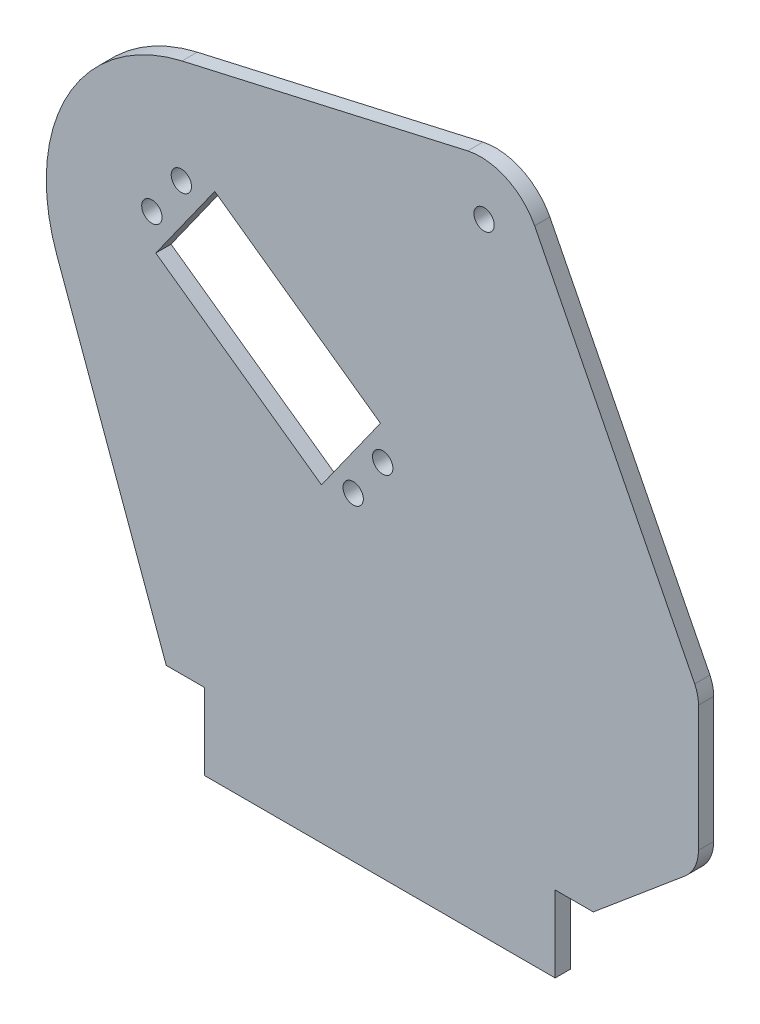
ISO-10303-21;
HEADER;
FILE_DESCRIPTION(('STEP AP214'),'2;1');
FILE_NAME('part.step','',(''),(''),'','','');
FILE_SCHEMA(('AUTOMOTIVE_DESIGN { 1 0 10303 214 1 1 1 1 }'));
ENDSEC;
DATA;
#1=APPLICATION_CONTEXT('core data for automotive mechanical design processes');
#2=APPLICATION_PROTOCOL_DEFINITION('international standard','automotive_design',2000,#1);
#3=PRODUCT_CONTEXT('',#1,'mechanical');
#4=PRODUCT('Part','Part','',(#3));
#5=PRODUCT_RELATED_PRODUCT_CATEGORY('part','',(#4));
#6=PRODUCT_DEFINITION_FORMATION('','',#4);
#7=PRODUCT_DEFINITION_CONTEXT('part definition',#1,'design');
#8=PRODUCT_DEFINITION('design','',#6,#7);
#9=PRODUCT_DEFINITION_SHAPE('','',#8);
#10=(LENGTH_UNIT() NAMED_UNIT(*) SI_UNIT(.MILLI.,.METRE.));
#11=(NAMED_UNIT(*) PLANE_ANGLE_UNIT() SI_UNIT($,.RADIAN.));
#12=(NAMED_UNIT(*) SI_UNIT($,.STERADIAN.) SOLID_ANGLE_UNIT());
#13=UNCERTAINTY_MEASURE_WITH_UNIT(LENGTH_MEASURE(1.E-05),#10,'distance_accuracy_value','');
#14=(GEOMETRIC_REPRESENTATION_CONTEXT(3) GLOBAL_UNCERTAINTY_ASSIGNED_CONTEXT((#13)) GLOBAL_UNIT_ASSIGNED_CONTEXT((#10,
#11,#12)) REPRESENTATION_CONTEXT('',''));
#15=CARTESIAN_POINT('',(0.,0.,0.));
#16=DIRECTION('',(0.,0.,1.));
#17=DIRECTION('',(1.,0.,0.));
#18=AXIS2_PLACEMENT_3D('',#15,#16,#17);
#19=CARTESIAN_POINT('',(52.5379588387498,0.97003609089329,3.));
#20=DIRECTION('',(0.,0.,1.));
#21=DIRECTION('',(1.,0.,0.));
#22=AXIS2_PLACEMENT_3D('',#19,#20,#21);
#23=PLANE('',#22);
#24=CARTESIAN_POINT('',(-41.6686655132375,39.4390380218527,3.));
#25=DIRECTION('',(0.,0.,1.));
#26=DIRECTION('',(1.,0.,0.));
#27=AXIS2_PLACEMENT_3D('',#24,#25,#26);
#28=CIRCLE('',#27,2.);
#29=CARTESIAN_POINT('',(-39.6686655132375,39.4390380218527,3.));
#30=VERTEX_POINT('',#29);
#31=EDGE_CURVE('E200',#30,#30,#28,.T.);
#32=ORIENTED_EDGE('',*,*,#31,.F.);
#33=EDGE_LOOP('',(#32));
#34=FACE_BOUND('',#33,.T.);
#35=CARTESIAN_POINT('',(-2.07349824916435,11.2577901905364,3.));
#36=DIRECTION('',(0.,0.,1.));
#37=DIRECTION('',(1.,0.,0.));
#38=AXIS2_PLACEMENT_3D('',#35,#36,#37);
#39=CIRCLE('',#38,2.);
#40=CARTESIAN_POINT('',(-0.0734982491643488,11.2577901905364,3.));
#41=VERTEX_POINT('',#40);
#42=EDGE_CURVE('E212',#41,#41,#39,.T.);
#43=ORIENTED_EDGE('',*,*,#42,.F.);
#44=EDGE_LOOP('',(#43));
#45=FACE_BOUND('',#44,.T.);
#46=CARTESIAN_POINT('',(52.5379588387498,0.97003609089329,3.));
#47=DIRECTION('',(0.,0.,1.));
#48=DIRECTION('',(1.,0.,0.));
#49=AXIS2_PLACEMENT_3D('',#46,#47,#48);
#50=CIRCLE('',#49,7.49999999999989);
#51=CARTESIAN_POINT('',(60.0379588387497,0.970036375484584,3.));
#52=VERTEX_POINT('',#51);
#53=CARTESIAN_POINT('',(59.2977934399142,4.21882604484534,3.));
#54=VERTEX_POINT('',#53);
#55=EDGE_CURVE('E224',#52,#54,#50,.T.);
#56=ORIENTED_EDGE('',*,*,#55,.T.);
#57=DIRECTION('',(-0.451103233471447,0.89247177700564,0.));
#58=VECTOR('',#57,1.);
#59=CARTESIAN_POINT('',(59.2977934399142,4.21882604484534,3.));
#60=LINE('',#59,#58);
#61=CARTESIAN_POINT('',(27.815049638073,66.5049242614765,3.));
#62=VERTEX_POINT('',#61);
#63=EDGE_CURVE('E227',#54,#62,#60,.T.);
#64=ORIENTED_EDGE('',*,*,#63,.T.);
#65=CARTESIAN_POINT('',(17.1739329491683,60.9581562283685,3.));
#66=DIRECTION('',(0.,0.,1.));
#67=DIRECTION('',(1.,0.,0.));
#68=AXIS2_PLACEMENT_3D('',#65,#66,#67);
#69=CIRCLE('',#68,11.9999999999998);
#70=CARTESIAN_POINT('',(14.6587671564007,72.6916101544248,3.));
#71=VERTEX_POINT('',#70);
#72=EDGE_CURVE('E230',#62,#71,#69,.T.);
#73=ORIENTED_EDGE('',*,*,#72,.T.);
#74=DIRECTION('',(-0.97509386621173,-0.221792587965108,0.));
#75=VECTOR('',#74,1.);
#76=CARTESIAN_POINT('',(14.6587671564007,72.6916101544248,3.));
#77=LINE('',#76,#75);
#78=CARTESIAN_POINT('',(-41.5350852683588,59.9098868876818,3.));
#79=VERTEX_POINT('',#78);
#80=EDGE_CURVE('E232',#71,#79,#77,.T.);
#81=ORIENTED_EDGE('',*,*,#80,.T.);
#82=CARTESIAN_POINT('',(-33.7366930159698,26.3028180140377,3.));
#83=DIRECTION('',(0.,0.,1.));
#84=DIRECTION('',(1.,0.,0.));
#85=AXIS2_PLACEMENT_3D('',#82,#83,#84);
#86=CIRCLE('',#85,34.4999999999997);
#87=CARTESIAN_POINT('',(-66.1560883434372,14.5031228230017,3.));
#88=VERTEX_POINT('',#87);
#89=EDGE_CURVE('E234',#79,#88,#86,.T.);
#90=ORIENTED_EDGE('',*,*,#89,.T.);
#91=DIRECTION('',(0.342020150464813,-0.939692618187472,0.));
#92=VECTOR('',#91,1.);
#93=CARTESIAN_POINT('',(-66.1560883434372,14.5031228230017,3.));
#94=LINE('',#93,#92);
#95=CARTESIAN_POINT('',(-44.6452411893587,-44.5974426091107,3.));
#96=VERTEX_POINT('',#95);
#97=EDGE_CURVE('E236',#88,#96,#94,.T.);
#98=ORIENTED_EDGE('',*,*,#97,.T.);
#99=DIRECTION('',(1.,0.,0.));
#100=VECTOR('',#99,1.);
#101=CARTESIAN_POINT('',(-44.6452411893587,-44.5974426091107,3.));
#102=LINE('',#101,#100);
#103=CARTESIAN_POINT('',(-37.1452431563582,-44.5974426091106,3.));
#104=VERTEX_POINT('',#103);
#105=EDGE_CURVE('E238',#96,#104,#102,.T.);
#106=ORIENTED_EDGE('',*,*,#105,.T.);
#107=DIRECTION('',(0.,-1.,0.));
#108=VECTOR('',#107,1.);
#109=CARTESIAN_POINT('',(-37.1452431563582,-44.5974426091106,3.));
#110=LINE('',#109,#108);
#111=CARTESIAN_POINT('',(-37.1452431563581,-59.5974426091107,3.));
#112=VERTEX_POINT('',#111);
#113=EDGE_CURVE('E240',#104,#112,#110,.T.);
#114=ORIENTED_EDGE('',*,*,#113,.T.);
#115=DIRECTION('',(1.,0.,0.));
#116=VECTOR('',#115,1.);
#117=CARTESIAN_POINT('',(-37.1452431563581,-59.5974426091107,3.));
#118=LINE('',#117,#116);
#119=CARTESIAN_POINT('',(31.8547568436419,-59.5974426091104,3.));
#120=VERTEX_POINT('',#119);
#121=EDGE_CURVE('E242',#112,#120,#118,.T.);
#122=ORIENTED_EDGE('',*,*,#121,.T.);
#123=DIRECTION('',(0.,1.,0.));
#124=VECTOR('',#123,1.);
#125=CARTESIAN_POINT('',(31.8547568436419,-59.5974426091104,3.));
#126=LINE('',#125,#124);
#127=CARTESIAN_POINT('',(31.8547568436418,-44.5974426091104,3.));
#128=VERTEX_POINT('',#127);
#129=EDGE_CURVE('E244',#120,#128,#126,.T.);
#130=ORIENTED_EDGE('',*,*,#129,.T.);
#131=DIRECTION('',(1.,0.,0.));
#132=VECTOR('',#131,1.);
#133=CARTESIAN_POINT('',(31.8547568436418,-44.5974426091104,3.));
#134=LINE('',#133,#132);
#135=CARTESIAN_POINT('',(39.3524228354522,-44.5974426091104,3.));
#136=VERTEX_POINT('',#135);
#137=EDGE_CURVE('E246',#128,#136,#134,.T.);
#138=ORIENTED_EDGE('',*,*,#137,.T.);
#139=DIRECTION('',(0.766044443118983,0.642787609686533,0.));
#140=VECTOR('',#139,1.);
#141=CARTESIAN_POINT('',(39.3524228354522,-44.5974426091104,3.));
#142=LINE('',#141,#140);
#143=CARTESIAN_POINT('',(57.4728017138443,-29.3926393754591,3.));
#144=VERTEX_POINT('',#143);
#145=EDGE_CURVE('E248',#136,#144,#142,.T.);
#146=ORIENTED_EDGE('',*,*,#145,.T.);
#147=CARTESIAN_POINT('',(52.5379588387497,-23.7448676203214,3.));
#148=DIRECTION('',(0.,0.,1.));
#149=DIRECTION('',(1.,0.,0.));
#150=AXIS2_PLACEMENT_3D('',#147,#148,#149);
#151=CIRCLE('',#150,7.50000000000025);
#152=CARTESIAN_POINT('',(60.0379588387499,-23.7448676203167,3.));
#153=VERTEX_POINT('',#152);
#154=EDGE_CURVE('E250',#144,#153,#151,.T.);
#155=ORIENTED_EDGE('',*,*,#154,.T.);
#156=DIRECTION('',(0.,1.,0.));
#157=VECTOR('',#156,1.);
#158=CARTESIAN_POINT('',(60.0379588387499,-23.7448676203167,3.));
#159=LINE('',#158,#157);
#160=EDGE_CURVE('E252',#153,#52,#159,.T.);
#161=ORIENTED_EDGE('',*,*,#160,.T.);
#162=EDGE_LOOP('',(#56,#64,#73,#81,#90,#98,#106,#114,#122,#130,#138,#146,#155,#161));
#163=FACE_BOUND('',#162,.T.);
#164=CARTESIAN_POINT('',(17.8698857742372,62.635186945819,3.));
#165=DIRECTION('',(0.,0.,1.));
#166=DIRECTION('',(1.,0.,0.));
#167=AXIS2_PLACEMENT_3D('',#164,#165,#166);
#168=CIRCLE('',#167,2.);
#169=CARTESIAN_POINT('',(19.8698857742372,62.635186945819,3.));
#170=VERTEX_POINT('',#169);
#171=EDGE_CURVE('E218',#170,#170,#168,.T.);
#172=ORIENTED_EDGE('',*,*,#171,.F.);
#173=EDGE_LOOP('',(#172));
#174=FACE_BOUND('',#173,.T.);
#175=CARTESIAN_POINT('',(-7.87210891404425,3.11063643249667,3.));
#176=DIRECTION('',(0.,0.,1.));
#177=DIRECTION('',(1.,0.,0.));
#178=AXIS2_PLACEMENT_3D('',#175,#176,#177);
#179=CIRCLE('',#178,2.);
#180=CARTESIAN_POINT('',(-5.87210891404425,3.11063643249667,3.));
#181=VERTEX_POINT('',#180);
#182=EDGE_CURVE('E206',#181,#181,#179,.T.);
#183=ORIENTED_EDGE('',*,*,#182,.F.);
#184=EDGE_LOOP('',(#183));
#185=FACE_BOUND('',#184,.T.);
#186=CARTESIAN_POINT('',(-47.4672761781174,31.291884263813,3.));
#187=DIRECTION('',(0.,0.,1.));
#188=DIRECTION('',(1.,0.,0.));
#189=AXIS2_PLACEMENT_3D('',#186,#187,#188);
#190=CIRCLE('',#189,2.);
#191=CARTESIAN_POINT('',(-45.4672761781174,31.291884263813,3.));
#192=VERTEX_POINT('',#191);
#193=EDGE_CURVE('E194',#192,#192,#190,.T.);
#194=ORIENTED_EDGE('',*,*,#193,.F.);
#195=EDGE_LOOP('',(#194));
#196=FACE_BOUND('',#195,.T.);
#197=DIRECTION('',(-0.814715375803975,0.579861066487989,0.));
#198=VECTOR('',#197,1.);
#199=CARTESIAN_POINT('',(-2.51452595752069,17.7087974421571,3.));
#200=LINE('',#199,#198);
#201=CARTESIAN_POINT('',(-2.51452595752069,17.7087974421571,3.));
#202=VERTEX_POINT('',#201);
#203=CARTESIAN_POINT('',(-35.1031409896797,40.9032401016766,3.));
#204=VERTEX_POINT('',#203);
#205=EDGE_CURVE('E165',#202,#204,#200,.T.);
#206=ORIENTED_EDGE('',*,*,#205,.F.);
#207=DIRECTION('',(0.579861066487989,0.814715375803975,0.));
#208=VECTOR('',#207,1.);
#209=CARTESIAN_POINT('',(-14.1117472872805,1.41448992607758,3.));
#210=LINE('',#209,#208);
#211=CARTESIAN_POINT('',(-14.1117472872805,1.41448992607758,3.));
#212=VERTEX_POINT('',#211);
#213=EDGE_CURVE('E157',#212,#202,#210,.T.);
#214=ORIENTED_EDGE('',*,*,#213,.F.);
#215=DIRECTION('',(0.814715375803975,-0.579861066487989,0.));
#216=VECTOR('',#215,1.);
#217=CARTESIAN_POINT('',(-46.7003623194395,24.6089325855972,3.));
#218=LINE('',#217,#216);
#219=CARTESIAN_POINT('',(-46.7003623194395,24.6089325855972,3.));
#220=VERTEX_POINT('',#219);
#221=EDGE_CURVE('E180',#220,#212,#218,.T.);
#222=ORIENTED_EDGE('',*,*,#221,.F.);
#223=DIRECTION('',(-0.579861066487989,-0.814715375803975,0.));
#224=VECTOR('',#223,1.);
#225=CARTESIAN_POINT('',(-35.1031409896797,40.9032401016766,3.));
#226=LINE('',#225,#224);
#227=EDGE_CURVE('E178',#204,#220,#226,.T.);
#228=ORIENTED_EDGE('',*,*,#227,.F.);
#229=EDGE_LOOP('',(#206,#214,#222,#228));
#230=FACE_BOUND('',#229,.T.);
#231=ADVANCED_FACE('F32',(#34,#45,#163,#174,#185,#196,#230),#23,.T.);
#232=CARTESIAN_POINT('',(52.5379588387498,0.97003609089329,0.));
#233=DIRECTION('',(0.,0.,1.));
#234=DIRECTION('',(1.,0.,0.));
#235=AXIS2_PLACEMENT_3D('',#232,#233,#234);
#236=PLANE('',#235);
#237=CARTESIAN_POINT('',(-47.4672761781174,31.291884263813,0.));
#238=DIRECTION('',(0.,0.,1.));
#239=DIRECTION('',(1.,0.,0.));
#240=AXIS2_PLACEMENT_3D('',#237,#238,#239);
#241=CIRCLE('',#240,2.);
#242=CARTESIAN_POINT('',(-45.4672761781174,31.291884263813,0.));
#243=VERTEX_POINT('',#242);
#244=EDGE_CURVE('E174',#243,#243,#241,.T.);
#245=ORIENTED_EDGE('',*,*,#244,.T.);
#246=EDGE_LOOP('',(#245));
#247=FACE_BOUND('',#246,.T.);
#248=CARTESIAN_POINT('',(-41.6686655132375,39.4390380218527,0.));
#249=DIRECTION('',(0.,0.,1.));
#250=DIRECTION('',(1.,0.,0.));
#251=AXIS2_PLACEMENT_3D('',#248,#249,#250);
#252=CIRCLE('',#251,2.);
#253=CARTESIAN_POINT('',(-39.6686655132375,39.4390380218527,0.));
#254=VERTEX_POINT('',#253);
#255=EDGE_CURVE('E197',#254,#254,#252,.T.);
#256=ORIENTED_EDGE('',*,*,#255,.T.);
#257=EDGE_LOOP('',(#256));
#258=FACE_BOUND('',#257,.T.);
#259=CARTESIAN_POINT('',(-7.87210891404425,3.11063643249667,0.));
#260=DIRECTION('',(0.,0.,1.));
#261=DIRECTION('',(1.,0.,0.));
#262=AXIS2_PLACEMENT_3D('',#259,#260,#261);
#263=CIRCLE('',#262,2.);
#264=CARTESIAN_POINT('',(-5.87210891404425,3.11063643249667,0.));
#265=VERTEX_POINT('',#264);
#266=EDGE_CURVE('E203',#265,#265,#263,.T.);
#267=ORIENTED_EDGE('',*,*,#266,.T.);
#268=EDGE_LOOP('',(#267));
#269=FACE_BOUND('',#268,.T.);
#270=CARTESIAN_POINT('',(-2.07349824916435,11.2577901905364,0.));
#271=DIRECTION('',(0.,0.,1.));
#272=DIRECTION('',(1.,0.,0.));
#273=AXIS2_PLACEMENT_3D('',#270,#271,#272);
#274=CIRCLE('',#273,2.);
#275=CARTESIAN_POINT('',(-0.0734982491643488,11.2577901905364,0.));
#276=VERTEX_POINT('',#275);
#277=EDGE_CURVE('E209',#276,#276,#274,.T.);
#278=ORIENTED_EDGE('',*,*,#277,.T.);
#279=EDGE_LOOP('',(#278));
#280=FACE_BOUND('',#279,.T.);
#281=CARTESIAN_POINT('',(17.8698857742372,62.635186945819,0.));
#282=DIRECTION('',(0.,0.,1.));
#283=DIRECTION('',(1.,0.,0.));
#284=AXIS2_PLACEMENT_3D('',#281,#282,#283);
#285=CIRCLE('',#284,2.);
#286=CARTESIAN_POINT('',(19.8698857742372,62.635186945819,0.));
#287=VERTEX_POINT('',#286);
#288=EDGE_CURVE('E215',#287,#287,#285,.T.);
#289=ORIENTED_EDGE('',*,*,#288,.T.);
#290=EDGE_LOOP('',(#289));
#291=FACE_BOUND('',#290,.T.);
#292=CARTESIAN_POINT('',(52.5379588387498,0.97003609089329,0.));
#293=DIRECTION('',(0.,0.,1.));
#294=DIRECTION('',(1.,0.,0.));
#295=AXIS2_PLACEMENT_3D('',#292,#293,#294);
#296=CIRCLE('',#295,7.49999999999989);
#297=CARTESIAN_POINT('',(60.0379588387497,0.970036375484584,0.));
#298=VERTEX_POINT('',#297);
#299=CARTESIAN_POINT('',(59.2977934399142,4.21882604484534,0.));
#300=VERTEX_POINT('',#299);
#301=EDGE_CURVE('E221',#298,#300,#296,.T.);
#302=ORIENTED_EDGE('',*,*,#301,.F.);
#303=DIRECTION('',(0.,1.,0.));
#304=VECTOR('',#303,1.);
#305=CARTESIAN_POINT('',(60.0379588387499,-23.7448676203167,0.));
#306=LINE('',#305,#304);
#307=CARTESIAN_POINT('',(60.0379588387499,-23.7448676203167,0.));
#308=VERTEX_POINT('',#307);
#309=EDGE_CURVE('E228',#308,#298,#306,.T.);
#310=ORIENTED_EDGE('',*,*,#309,.F.);
#311=CARTESIAN_POINT('',(52.5379588387497,-23.7448676203214,0.));
#312=DIRECTION('',(0.,0.,1.));
#313=DIRECTION('',(1.,0.,0.));
#314=AXIS2_PLACEMENT_3D('',#311,#312,#313);
#315=CIRCLE('',#314,7.50000000000025);
#316=CARTESIAN_POINT('',(57.4728017138443,-29.3926393754591,0.));
#317=VERTEX_POINT('',#316);
#318=EDGE_CURVE('E279',#317,#308,#315,.T.);
#319=ORIENTED_EDGE('',*,*,#318,.F.);
#320=DIRECTION('',(0.766044443118983,0.642787609686533,0.));
#321=VECTOR('',#320,1.);
#322=CARTESIAN_POINT('',(39.3524228354522,-44.5974426091104,0.));
#323=LINE('',#322,#321);
#324=CARTESIAN_POINT('',(39.3524228354522,-44.5974426091104,0.));
#325=VERTEX_POINT('',#324);
#326=EDGE_CURVE('E277',#325,#317,#323,.T.);
#327=ORIENTED_EDGE('',*,*,#326,.F.);
#328=DIRECTION('',(1.,0.,0.));
#329=VECTOR('',#328,1.);
#330=CARTESIAN_POINT('',(31.8547568436418,-44.5974426091104,0.));
#331=LINE('',#330,#329);
#332=CARTESIAN_POINT('',(31.8547568436418,-44.5974426091104,0.));
#333=VERTEX_POINT('',#332);
#334=EDGE_CURVE('E275',#333,#325,#331,.T.);
#335=ORIENTED_EDGE('',*,*,#334,.F.);
#336=DIRECTION('',(0.,1.,0.));
#337=VECTOR('',#336,1.);
#338=CARTESIAN_POINT('',(31.8547568436419,-59.5974426091104,0.));
#339=LINE('',#338,#337);
#340=CARTESIAN_POINT('',(31.8547568436419,-59.5974426091104,0.));
#341=VERTEX_POINT('',#340);
#342=EDGE_CURVE('E273',#341,#333,#339,.T.);
#343=ORIENTED_EDGE('',*,*,#342,.F.);
#344=DIRECTION('',(1.,0.,0.));
#345=VECTOR('',#344,1.);
#346=CARTESIAN_POINT('',(-37.1452431563581,-59.5974426091107,0.));
#347=LINE('',#346,#345);
#348=CARTESIAN_POINT('',(-37.1452431563581,-59.5974426091107,0.));
#349=VERTEX_POINT('',#348);
#350=EDGE_CURVE('E271',#349,#341,#347,.T.);
#351=ORIENTED_EDGE('',*,*,#350,.F.);
#352=DIRECTION('',(0.,-1.,0.));
#353=VECTOR('',#352,1.);
#354=CARTESIAN_POINT('',(-37.1452431563582,-44.5974426091106,0.));
#355=LINE('',#354,#353);
#356=CARTESIAN_POINT('',(-37.1452431563582,-44.5974426091106,0.));
#357=VERTEX_POINT('',#356);
#358=EDGE_CURVE('E269',#357,#349,#355,.T.);
#359=ORIENTED_EDGE('',*,*,#358,.F.);
#360=DIRECTION('',(1.,0.,0.));
#361=VECTOR('',#360,1.);
#362=CARTESIAN_POINT('',(-44.6452411893587,-44.5974426091107,0.));
#363=LINE('',#362,#361);
#364=CARTESIAN_POINT('',(-44.6452411893587,-44.5974426091107,0.));
#365=VERTEX_POINT('',#364);
#366=EDGE_CURVE('E267',#365,#357,#363,.T.);
#367=ORIENTED_EDGE('',*,*,#366,.F.);
#368=DIRECTION('',(0.342020150464813,-0.939692618187472,0.));
#369=VECTOR('',#368,1.);
#370=CARTESIAN_POINT('',(-66.1560883434372,14.5031228230017,0.));
#371=LINE('',#370,#369);
#372=CARTESIAN_POINT('',(-66.1560883434372,14.5031228230017,0.));
#373=VERTEX_POINT('',#372);
#374=EDGE_CURVE('E265',#373,#365,#371,.T.);
#375=ORIENTED_EDGE('',*,*,#374,.F.);
#376=CARTESIAN_POINT('',(-33.7366930159698,26.3028180140377,0.));
#377=DIRECTION('',(0.,0.,1.));
#378=DIRECTION('',(1.,0.,0.));
#379=AXIS2_PLACEMENT_3D('',#376,#377,#378);
#380=CIRCLE('',#379,34.4999999999997);
#381=CARTESIAN_POINT('',(-41.5350852683588,59.9098868876818,0.));
#382=VERTEX_POINT('',#381);
#383=EDGE_CURVE('E263',#382,#373,#380,.T.);
#384=ORIENTED_EDGE('',*,*,#383,.F.);
#385=DIRECTION('',(-0.97509386621173,-0.221792587965108,0.));
#386=VECTOR('',#385,1.);
#387=CARTESIAN_POINT('',(14.6587671564007,72.6916101544248,0.));
#388=LINE('',#387,#386);
#389=CARTESIAN_POINT('',(14.6587671564007,72.6916101544248,0.));
#390=VERTEX_POINT('',#389);
#391=EDGE_CURVE('E261',#390,#382,#388,.T.);
#392=ORIENTED_EDGE('',*,*,#391,.F.);
#393=CARTESIAN_POINT('',(17.1739329491683,60.9581562283685,0.));
#394=DIRECTION('',(0.,0.,1.));
#395=DIRECTION('',(1.,0.,0.));
#396=AXIS2_PLACEMENT_3D('',#393,#394,#395);
#397=CIRCLE('',#396,11.9999999999998);
#398=CARTESIAN_POINT('',(27.815049638073,66.5049242614765,0.));
#399=VERTEX_POINT('',#398);
#400=EDGE_CURVE('E259',#399,#390,#397,.T.);
#401=ORIENTED_EDGE('',*,*,#400,.F.);
#402=DIRECTION('',(-0.451103233471447,0.89247177700564,0.));
#403=VECTOR('',#402,1.);
#404=CARTESIAN_POINT('',(59.2977934399142,4.21882604484534,0.));
#405=LINE('',#404,#403);
#406=EDGE_CURVE('E257',#300,#399,#405,.T.);
#407=ORIENTED_EDGE('',*,*,#406,.F.);
#408=EDGE_LOOP('',(#302,#310,#319,#327,#335,#343,#351,#359,#367,#375,#384,#392,#401,#407));
#409=FACE_BOUND('',#408,.T.);
#410=DIRECTION('',(0.579861066487989,0.814715375803975,0.));
#411=VECTOR('',#410,1.);
#412=CARTESIAN_POINT('',(-14.1117472872805,1.41448992607758,0.));
#413=LINE('',#412,#411);
#414=CARTESIAN_POINT('',(-14.1117472872805,1.41448992607758,0.));
#415=VERTEX_POINT('',#414);
#416=CARTESIAN_POINT('',(-2.51452595752069,17.7087974421571,0.));
#417=VERTEX_POINT('',#416);
#418=EDGE_CURVE('E55',#415,#417,#413,.T.);
#419=ORIENTED_EDGE('',*,*,#418,.T.);
#420=DIRECTION('',(-0.814715375803975,0.579861066487989,0.));
#421=VECTOR('',#420,1.);
#422=CARTESIAN_POINT('',(-2.51452595752069,17.7087974421571,0.));
#423=LINE('',#422,#421);
#424=CARTESIAN_POINT('',(-35.1031409896797,40.9032401016766,0.));
#425=VERTEX_POINT('',#424);
#426=EDGE_CURVE('E173',#417,#425,#423,.T.);
#427=ORIENTED_EDGE('',*,*,#426,.T.);
#428=DIRECTION('',(-0.579861066487989,-0.814715375803974,0.));
#429=VECTOR('',#428,1.);
#430=CARTESIAN_POINT('',(-40.9017516545596,32.7560863436369,0.));
#431=LINE('',#430,#429);
#432=CARTESIAN_POINT('',(-46.7003623194395,24.6089325855972,0.));
#433=VERTEX_POINT('',#432);
#434=EDGE_CURVE('E186',#425,#433,#431,.T.);
#435=ORIENTED_EDGE('',*,*,#434,.T.);
#436=DIRECTION('',(0.814715375803975,-0.579861066487989,0.));
#437=VECTOR('',#436,1.);
#438=CARTESIAN_POINT('',(-46.7003623194395,24.6089325855972,0.));
#439=LINE('',#438,#437);
#440=EDGE_CURVE('E166',#433,#415,#439,.T.);
#441=ORIENTED_EDGE('',*,*,#440,.T.);
#442=EDGE_LOOP('',(#419,#427,#435,#441));
#443=FACE_BOUND('',#442,.T.);
#444=ADVANCED_FACE('F327',(#247,#258,#269,#280,#291,#409,#443),#236,.F.);
#445=CARTESIAN_POINT('',(52.5379588387498,0.97003609089329,3.));
#446=DIRECTION('',(0.,0.,-1.));
#447=DIRECTION('',(-1.,0.,0.));
#448=AXIS2_PLACEMENT_3D('',#445,#446,#447);
#449=CYLINDRICAL_SURFACE('',#448,7.49999999999989);
#450=ORIENTED_EDGE('',*,*,#301,.T.);
#451=DIRECTION('',(0.,0.,-1.));
#452=VECTOR('',#451,1.);
#453=CARTESIAN_POINT('',(59.2977934399142,4.21882604484534,3.));
#454=LINE('',#453,#452);
#455=EDGE_CURVE('E11',#54,#300,#454,.T.);
#456=ORIENTED_EDGE('',*,*,#455,.F.);
#457=ORIENTED_EDGE('',*,*,#55,.F.);
#458=DIRECTION('',(0.,0.,-1.));
#459=VECTOR('',#458,1.);
#460=CARTESIAN_POINT('',(60.0379588387497,0.970036375484584,3.));
#461=LINE('',#460,#459);
#462=EDGE_CURVE('E254',#52,#298,#461,.T.);
#463=ORIENTED_EDGE('',*,*,#462,.T.);
#464=EDGE_LOOP('',(#450,#456,#457,#463));
#465=FACE_BOUND('',#464,.T.);
#466=ADVANCED_FACE('F34',(#465),#449,.T.);
#467=CARTESIAN_POINT('',(59.2977934399142,4.21882604484534,3.));
#468=DIRECTION('',(-0.89247177700564,-0.451103233471447,0.));
#469=DIRECTION('',(0.451103233471447,-0.89247177700564,0.));
#470=AXIS2_PLACEMENT_3D('',#467,#468,#469);
#471=PLANE('',#470);
#472=ORIENTED_EDGE('',*,*,#406,.T.);
#473=DIRECTION('',(0.,0.,-1.));
#474=VECTOR('',#473,1.);
#475=CARTESIAN_POINT('',(27.815049638073,66.5049242614765,3.));
#476=LINE('',#475,#474);
#477=EDGE_CURVE('E40',#62,#399,#476,.T.);
#478=ORIENTED_EDGE('',*,*,#477,.F.);
#479=ORIENTED_EDGE('',*,*,#63,.F.);
#480=ORIENTED_EDGE('',*,*,#455,.T.);
#481=EDGE_LOOP('',(#472,#478,#479,#480));
#482=FACE_BOUND('',#481,.T.);
#483=ADVANCED_FACE('F345',(#482),#471,.F.);
#484=CARTESIAN_POINT('',(17.1739329491683,60.9581562283685,3.));
#485=DIRECTION('',(0.,0.,-1.));
#486=DIRECTION('',(-1.,0.,0.));
#487=AXIS2_PLACEMENT_3D('',#484,#485,#486);
#488=CYLINDRICAL_SURFACE('',#487,11.9999999999998);
#489=ORIENTED_EDGE('',*,*,#400,.T.);
#490=DIRECTION('',(0.,0.,-1.));
#491=VECTOR('',#490,1.);
#492=CARTESIAN_POINT('',(14.6587671564007,72.6916101544248,3.));
#493=LINE('',#492,#491);
#494=EDGE_CURVE('E314',#71,#390,#493,.T.);
#495=ORIENTED_EDGE('',*,*,#494,.F.);
#496=ORIENTED_EDGE('',*,*,#72,.F.);
#497=ORIENTED_EDGE('',*,*,#477,.T.);
#498=EDGE_LOOP('',(#489,#495,#496,#497));
#499=FACE_BOUND('',#498,.T.);
#500=ADVANCED_FACE('F321',(#499),#488,.T.);
#501=CARTESIAN_POINT('',(14.6587671564007,72.6916101544248,3.));
#502=DIRECTION('',(0.221792587965108,-0.97509386621173,0.));
#503=DIRECTION('',(0.97509386621173,0.221792587965108,0.));
#504=AXIS2_PLACEMENT_3D('',#501,#502,#503);
#505=PLANE('',#504);
#506=ORIENTED_EDGE('',*,*,#391,.T.);
#507=DIRECTION('',(0.,0.,-1.));
#508=VECTOR('',#507,1.);
#509=CARTESIAN_POINT('',(-41.5350852683588,59.9098868876818,3.));
#510=LINE('',#509,#508);
#511=EDGE_CURVE('E311',#79,#382,#510,.T.);
#512=ORIENTED_EDGE('',*,*,#511,.F.);
#513=ORIENTED_EDGE('',*,*,#80,.F.);
#514=ORIENTED_EDGE('',*,*,#494,.T.);
#515=EDGE_LOOP('',(#506,#512,#513,#514));
#516=FACE_BOUND('',#515,.T.);
#517=ADVANCED_FACE('F333',(#516),#505,.F.);
#518=CARTESIAN_POINT('',(-33.7366930159698,26.3028180140377,3.));
#519=DIRECTION('',(0.,0.,-1.));
#520=DIRECTION('',(-1.,0.,0.));
#521=AXIS2_PLACEMENT_3D('',#518,#519,#520);
#522=CYLINDRICAL_SURFACE('',#521,34.4999999999997);
#523=ORIENTED_EDGE('',*,*,#383,.T.);
#524=DIRECTION('',(0.,0.,-1.));
#525=VECTOR('',#524,1.);
#526=CARTESIAN_POINT('',(-66.1560883434372,14.5031228230017,3.));
#527=LINE('',#526,#525);
#528=EDGE_CURVE('E308',#88,#373,#527,.T.);
#529=ORIENTED_EDGE('',*,*,#528,.F.);
#530=ORIENTED_EDGE('',*,*,#89,.F.);
#531=ORIENTED_EDGE('',*,*,#511,.T.);
#532=EDGE_LOOP('',(#523,#529,#530,#531));
#533=FACE_BOUND('',#532,.T.);
#534=ADVANCED_FACE('F337',(#533),#522,.T.);
#535=CARTESIAN_POINT('',(-66.1560883434372,14.5031228230017,3.));
#536=DIRECTION('',(0.939692618187472,0.342020150464813,0.));
#537=DIRECTION('',(-0.342020150464813,0.939692618187472,0.));
#538=AXIS2_PLACEMENT_3D('',#535,#536,#537);
#539=PLANE('',#538);
#540=ORIENTED_EDGE('',*,*,#374,.T.);
#541=DIRECTION('',(0.,0.,-1.));
#542=VECTOR('',#541,1.);
#543=CARTESIAN_POINT('',(-44.6452411893587,-44.5974426091107,3.));
#544=LINE('',#543,#542);
#545=EDGE_CURVE('E305',#96,#365,#544,.T.);
#546=ORIENTED_EDGE('',*,*,#545,.F.);
#547=ORIENTED_EDGE('',*,*,#97,.F.);
#548=ORIENTED_EDGE('',*,*,#528,.T.);
#549=EDGE_LOOP('',(#540,#546,#547,#548));
#550=FACE_BOUND('',#549,.T.);
#551=ADVANCED_FACE('F388',(#550),#539,.F.);
#552=CARTESIAN_POINT('',(-44.6452411893587,-44.5974426091107,3.));
#553=DIRECTION('',(0.,1.,0.));
#554=DIRECTION('',(-1.,0.,0.));
#555=AXIS2_PLACEMENT_3D('',#552,#553,#554);
#556=PLANE('',#555);
#557=ORIENTED_EDGE('',*,*,#366,.T.);
#558=DIRECTION('',(0.,0.,-1.));
#559=VECTOR('',#558,1.);
#560=CARTESIAN_POINT('',(-37.1452431563582,-44.5974426091106,3.));
#561=LINE('',#560,#559);
#562=EDGE_CURVE('E302',#104,#357,#561,.T.);
#563=ORIENTED_EDGE('',*,*,#562,.F.);
#564=ORIENTED_EDGE('',*,*,#105,.F.);
#565=ORIENTED_EDGE('',*,*,#545,.T.);
#566=EDGE_LOOP('',(#557,#563,#564,#565));
#567=FACE_BOUND('',#566,.T.);
#568=ADVANCED_FACE('F386',(#567),#556,.F.);
#569=CARTESIAN_POINT('',(-37.1452431563582,-44.5974426091106,3.));
#570=DIRECTION('',(1.,0.,0.));
#571=DIRECTION('',(0.,1.,0.));
#572=AXIS2_PLACEMENT_3D('',#569,#570,#571);
#573=PLANE('',#572);
#574=ORIENTED_EDGE('',*,*,#358,.T.);
#575=DIRECTION('',(0.,0.,-1.));
#576=VECTOR('',#575,1.);
#577=CARTESIAN_POINT('',(-37.1452431563581,-59.5974426091107,3.));
#578=LINE('',#577,#576);
#579=EDGE_CURVE('E299',#112,#349,#578,.T.);
#580=ORIENTED_EDGE('',*,*,#579,.F.);
#581=ORIENTED_EDGE('',*,*,#113,.F.);
#582=ORIENTED_EDGE('',*,*,#562,.T.);
#583=EDGE_LOOP('',(#574,#580,#581,#582));
#584=FACE_BOUND('',#583,.T.);
#585=ADVANCED_FACE('F381',(#584),#573,.F.);
#586=CARTESIAN_POINT('',(-37.1452431563581,-59.5974426091107,3.));
#587=DIRECTION('',(0.,1.,0.));
#588=DIRECTION('',(-1.,0.,0.));
#589=AXIS2_PLACEMENT_3D('',#586,#587,#588);
#590=PLANE('',#589);
#591=ORIENTED_EDGE('',*,*,#350,.T.);
#592=DIRECTION('',(0.,0.,-1.));
#593=VECTOR('',#592,1.);
#594=CARTESIAN_POINT('',(31.8547568436419,-59.5974426091104,3.));
#595=LINE('',#594,#593);
#596=EDGE_CURVE('E296',#120,#341,#595,.T.);
#597=ORIENTED_EDGE('',*,*,#596,.F.);
#598=ORIENTED_EDGE('',*,*,#121,.F.);
#599=ORIENTED_EDGE('',*,*,#579,.T.);
#600=EDGE_LOOP('',(#591,#597,#598,#599));
#601=FACE_BOUND('',#600,.T.);
#602=ADVANCED_FACE('F376',(#601),#590,.F.);
#603=CARTESIAN_POINT('',(31.8547568436419,-59.5974426091104,3.));
#604=DIRECTION('',(-1.,0.,0.));
#605=DIRECTION('',(0.,-1.,0.));
#606=AXIS2_PLACEMENT_3D('',#603,#604,#605);
#607=PLANE('',#606);
#608=ORIENTED_EDGE('',*,*,#342,.T.);
#609=DIRECTION('',(0.,0.,-1.));
#610=VECTOR('',#609,1.);
#611=CARTESIAN_POINT('',(31.8547568436418,-44.5974426091104,3.));
#612=LINE('',#611,#610);
#613=EDGE_CURVE('E293',#128,#333,#612,.T.);
#614=ORIENTED_EDGE('',*,*,#613,.F.);
#615=ORIENTED_EDGE('',*,*,#129,.F.);
#616=ORIENTED_EDGE('',*,*,#596,.T.);
#617=EDGE_LOOP('',(#608,#614,#615,#616));
#618=FACE_BOUND('',#617,.T.);
#619=ADVANCED_FACE('F372',(#618),#607,.F.);
#620=CARTESIAN_POINT('',(31.8547568436418,-44.5974426091104,3.));
#621=DIRECTION('',(0.,1.,0.));
#622=DIRECTION('',(-1.,0.,0.));
#623=AXIS2_PLACEMENT_3D('',#620,#621,#622);
#624=PLANE('',#623);
#625=ORIENTED_EDGE('',*,*,#334,.T.);
#626=DIRECTION('',(0.,0.,-1.));
#627=VECTOR('',#626,1.);
#628=CARTESIAN_POINT('',(39.3524228354522,-44.5974426091104,3.));
#629=LINE('',#628,#627);
#630=EDGE_CURVE('E290',#136,#325,#629,.T.);
#631=ORIENTED_EDGE('',*,*,#630,.F.);
#632=ORIENTED_EDGE('',*,*,#137,.F.);
#633=ORIENTED_EDGE('',*,*,#613,.T.);
#634=EDGE_LOOP('',(#625,#631,#632,#633));
#635=FACE_BOUND('',#634,.T.);
#636=ADVANCED_FACE('F367',(#635),#624,.F.);
#637=CARTESIAN_POINT('',(39.3524228354522,-44.5974426091104,3.));
#638=DIRECTION('',(-0.642787609686533,0.766044443118983,0.));
#639=DIRECTION('',(-0.766044443118983,-0.642787609686533,0.));
#640=AXIS2_PLACEMENT_3D('',#637,#638,#639);
#641=PLANE('',#640);
#642=ORIENTED_EDGE('',*,*,#326,.T.);
#643=DIRECTION('',(0.,0.,-1.));
#644=VECTOR('',#643,1.);
#645=CARTESIAN_POINT('',(57.4728017138443,-29.3926393754591,3.));
#646=LINE('',#645,#644);
#647=EDGE_CURVE('E287',#144,#317,#646,.T.);
#648=ORIENTED_EDGE('',*,*,#647,.F.);
#649=ORIENTED_EDGE('',*,*,#145,.F.);
#650=ORIENTED_EDGE('',*,*,#630,.T.);
#651=EDGE_LOOP('',(#642,#648,#649,#650));
#652=FACE_BOUND('',#651,.T.);
#653=ADVANCED_FACE('F361',(#652),#641,.F.);
#654=CARTESIAN_POINT('',(52.5379588387497,-23.7448676203214,3.));
#655=DIRECTION('',(0.,0.,-1.));
#656=DIRECTION('',(-1.,0.,0.));
#657=AXIS2_PLACEMENT_3D('',#654,#655,#656);
#658=CYLINDRICAL_SURFACE('',#657,7.50000000000025);
#659=ORIENTED_EDGE('',*,*,#318,.T.);
#660=DIRECTION('',(0.,0.,-1.));
#661=VECTOR('',#660,1.);
#662=CARTESIAN_POINT('',(60.0379588387499,-23.7448676203167,3.));
#663=LINE('',#662,#661);
#664=EDGE_CURVE('E284',#153,#308,#663,.T.);
#665=ORIENTED_EDGE('',*,*,#664,.F.);
#666=ORIENTED_EDGE('',*,*,#154,.F.);
#667=ORIENTED_EDGE('',*,*,#647,.T.);
#668=EDGE_LOOP('',(#659,#665,#666,#667));
#669=FACE_BOUND('',#668,.T.);
#670=ADVANCED_FACE('F357',(#669),#658,.T.);
#671=CARTESIAN_POINT('',(60.0379588387499,-23.7448676203167,3.));
#672=DIRECTION('',(-1.,0.,0.));
#673=DIRECTION('',(0.,-1.,0.));
#674=AXIS2_PLACEMENT_3D('',#671,#672,#673);
#675=PLANE('',#674);
#676=ORIENTED_EDGE('',*,*,#309,.T.);
#677=ORIENTED_EDGE('',*,*,#462,.F.);
#678=ORIENTED_EDGE('',*,*,#160,.F.);
#679=ORIENTED_EDGE('',*,*,#664,.T.);
#680=EDGE_LOOP('',(#676,#677,#678,#679));
#681=FACE_BOUND('',#680,.T.);
#682=ADVANCED_FACE('F352',(#681),#675,.F.);
#683=CARTESIAN_POINT('',(17.8698857742372,62.635186945819,3.));
#684=DIRECTION('',(0.,0.,-1.));
#685=DIRECTION('',(-1.,0.,0.));
#686=AXIS2_PLACEMENT_3D('',#683,#684,#685);
#687=CYLINDRICAL_SURFACE('',#686,2.);
#688=ORIENTED_EDGE('',*,*,#171,.T.);
#689=EDGE_LOOP('',(#688));
#690=FACE_BOUND('',#689,.T.);
#691=ORIENTED_EDGE('',*,*,#288,.F.);
#692=EDGE_LOOP('',(#691));
#693=FACE_BOUND('',#692,.T.);
#694=ADVANCED_FACE('F408',(#690,#693),#687,.F.);
#695=CARTESIAN_POINT('',(-2.07349824916435,11.2577901905364,3.));
#696=DIRECTION('',(0.,0.,-1.));
#697=DIRECTION('',(-1.,0.,0.));
#698=AXIS2_PLACEMENT_3D('',#695,#696,#697);
#699=CYLINDRICAL_SURFACE('',#698,2.);
#700=ORIENTED_EDGE('',*,*,#42,.T.);
#701=EDGE_LOOP('',(#700));
#702=FACE_BOUND('',#701,.T.);
#703=ORIENTED_EDGE('',*,*,#277,.F.);
#704=EDGE_LOOP('',(#703));
#705=FACE_BOUND('',#704,.T.);
#706=ADVANCED_FACE('F458',(#702,#705),#699,.F.);
#707=CARTESIAN_POINT('',(-7.87210891404425,3.11063643249667,3.));
#708=DIRECTION('',(0.,0.,-1.));
#709=DIRECTION('',(-1.,0.,0.));
#710=AXIS2_PLACEMENT_3D('',#707,#708,#709);
#711=CYLINDRICAL_SURFACE('',#710,2.);
#712=ORIENTED_EDGE('',*,*,#182,.T.);
#713=EDGE_LOOP('',(#712));
#714=FACE_BOUND('',#713,.T.);
#715=ORIENTED_EDGE('',*,*,#266,.F.);
#716=EDGE_LOOP('',(#715));
#717=FACE_BOUND('',#716,.T.);
#718=ADVANCED_FACE('F465',(#714,#717),#711,.F.);
#719=CARTESIAN_POINT('',(-41.6686655132375,39.4390380218527,3.));
#720=DIRECTION('',(0.,0.,-1.));
#721=DIRECTION('',(-1.,0.,0.));
#722=AXIS2_PLACEMENT_3D('',#719,#720,#721);
#723=CYLINDRICAL_SURFACE('',#722,2.);
#724=ORIENTED_EDGE('',*,*,#31,.T.);
#725=EDGE_LOOP('',(#724));
#726=FACE_BOUND('',#725,.T.);
#727=ORIENTED_EDGE('',*,*,#255,.F.);
#728=EDGE_LOOP('',(#727));
#729=FACE_BOUND('',#728,.T.);
#730=ADVANCED_FACE('F472',(#726,#729),#723,.F.);
#731=CARTESIAN_POINT('',(-47.4672761781174,31.291884263813,3.));
#732=DIRECTION('',(0.,0.,-1.));
#733=DIRECTION('',(-1.,0.,0.));
#734=AXIS2_PLACEMENT_3D('',#731,#732,#733);
#735=CYLINDRICAL_SURFACE('',#734,2.);
#736=ORIENTED_EDGE('',*,*,#193,.T.);
#737=EDGE_LOOP('',(#736));
#738=FACE_BOUND('',#737,.T.);
#739=ORIENTED_EDGE('',*,*,#244,.F.);
#740=EDGE_LOOP('',(#739));
#741=FACE_BOUND('',#740,.T.);
#742=ADVANCED_FACE('F480',(#738,#741),#735,.F.);
#743=CARTESIAN_POINT('',(-14.1117472872805,1.41448992607758,3.));
#744=DIRECTION('',(-0.814715375803975,0.579861066487989,0.));
#745=DIRECTION('',(-0.579861066487989,-0.814715375803975,0.));
#746=AXIS2_PLACEMENT_3D('',#743,#744,#745);
#747=PLANE('',#746);
#748=ORIENTED_EDGE('',*,*,#418,.F.);
#749=DIRECTION('',(0.,0.,-1.));
#750=VECTOR('',#749,1.);
#751=CARTESIAN_POINT('',(-14.1117472872805,1.41448992607758,3.));
#752=LINE('',#751,#750);
#753=EDGE_CURVE('E161',#212,#415,#752,.T.);
#754=ORIENTED_EDGE('',*,*,#753,.F.);
#755=ORIENTED_EDGE('',*,*,#213,.T.);
#756=DIRECTION('',(0.,0.,-1.));
#757=VECTOR('',#756,1.);
#758=CARTESIAN_POINT('',(-2.51452595752069,17.7087974421571,3.));
#759=LINE('',#758,#757);
#760=EDGE_CURVE('E160',#202,#417,#759,.T.);
#761=ORIENTED_EDGE('',*,*,#760,.T.);
#762=EDGE_LOOP('',(#748,#754,#755,#761));
#763=FACE_BOUND('',#762,.T.);
#764=ADVANCED_FACE('F159',(#763),#747,.T.);
#765=CARTESIAN_POINT('',(-2.51452595752069,17.7087974421571,3.));
#766=DIRECTION('',(-0.579861066487989,-0.814715375803975,0.));
#767=DIRECTION('',(0.814715375803975,-0.579861066487989,0.));
#768=AXIS2_PLACEMENT_3D('',#765,#766,#767);
#769=PLANE('',#768);
#770=ORIENTED_EDGE('',*,*,#426,.F.);
#771=ORIENTED_EDGE('',*,*,#760,.F.);
#772=ORIENTED_EDGE('',*,*,#205,.T.);
#773=DIRECTION('',(0.,0.,-1.));
#774=VECTOR('',#773,1.);
#775=CARTESIAN_POINT('',(-35.1031409896797,40.9032401016766,3.));
#776=LINE('',#775,#774);
#777=EDGE_CURVE('E175',#204,#425,#776,.T.);
#778=ORIENTED_EDGE('',*,*,#777,.T.);
#779=EDGE_LOOP('',(#770,#771,#772,#778));
#780=FACE_BOUND('',#779,.T.);
#781=ADVANCED_FACE('F169',(#780),#769,.T.);
#782=CARTESIAN_POINT('',(-40.9017516545596,32.7560863436369,3.));
#783=DIRECTION('',(0.814715375803975,-0.579861066487989,0.));
#784=DIRECTION('',(0.579861066487989,0.814715375803975,0.));
#785=AXIS2_PLACEMENT_3D('',#782,#783,#784);
#786=PLANE('',#785);
#787=ORIENTED_EDGE('',*,*,#434,.F.);
#788=ORIENTED_EDGE('',*,*,#777,.F.);
#789=ORIENTED_EDGE('',*,*,#227,.T.);
#790=DIRECTION('',(0.,0.,-1.));
#791=VECTOR('',#790,1.);
#792=CARTESIAN_POINT('',(-46.7003623194395,24.6089325855972,3.));
#793=LINE('',#792,#791);
#794=EDGE_CURVE('E47',#220,#433,#793,.T.);
#795=ORIENTED_EDGE('',*,*,#794,.T.);
#796=EDGE_LOOP('',(#787,#788,#789,#795));
#797=FACE_BOUND('',#796,.T.);
#798=ADVANCED_FACE('F501',(#797),#786,.T.);
#799=CARTESIAN_POINT('',(-46.7003623194395,24.6089325855972,3.));
#800=DIRECTION('',(0.579861066487989,0.814715375803975,0.));
#801=DIRECTION('',(-0.814715375803975,0.579861066487989,0.));
#802=AXIS2_PLACEMENT_3D('',#799,#800,#801);
#803=PLANE('',#802);
#804=ORIENTED_EDGE('',*,*,#440,.F.);
#805=ORIENTED_EDGE('',*,*,#794,.F.);
#806=ORIENTED_EDGE('',*,*,#221,.T.);
#807=ORIENTED_EDGE('',*,*,#753,.T.);
#808=EDGE_LOOP('',(#804,#805,#806,#807));
#809=FACE_BOUND('',#808,.T.);
#810=ADVANCED_FACE('F508',(#809),#803,.T.);
#811=CLOSED_SHELL('',(#231,#444,#466,#483,#500,#517,#534,#551,#568,#585,#602,#619,#636,#653,
#670,#682,#694,#706,#718,#730,#742,#764,#781,#798,#810));
#812=MANIFOLD_SOLID_BREP('B2',#811);
#813=ADVANCED_BREP_SHAPE_REPRESENTATION('',(#18,#812),#14);
#814=SHAPE_DEFINITION_REPRESENTATION(#9,#813);
ENDSEC;
END-ISO-10303-21;
